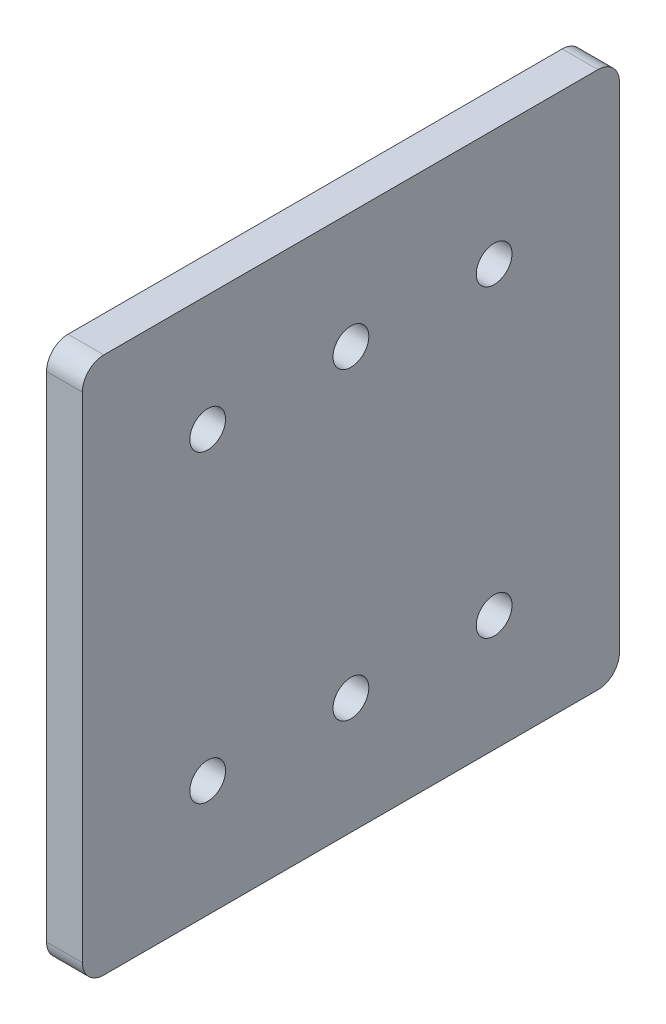
ISO-10303-21;
HEADER;
FILE_DESCRIPTION(('STEP AP214'),'2;1');
FILE_NAME('part.step','',(''),(''),'','','');
FILE_SCHEMA(('AUTOMOTIVE_DESIGN { 1 0 10303 214 1 1 1 1 }'));
ENDSEC;
DATA;
#1=APPLICATION_CONTEXT('core data for automotive mechanical design processes');
#2=APPLICATION_PROTOCOL_DEFINITION('international standard','automotive_design',2000,#1);
#3=PRODUCT_CONTEXT('',#1,'mechanical');
#4=PRODUCT('Part','Part','',(#3));
#5=PRODUCT_RELATED_PRODUCT_CATEGORY('part','',(#4));
#6=PRODUCT_DEFINITION_FORMATION('','',#4);
#7=PRODUCT_DEFINITION_CONTEXT('part definition',#1,'design');
#8=PRODUCT_DEFINITION('design','',#6,#7);
#9=PRODUCT_DEFINITION_SHAPE('','',#8);
#10=(LENGTH_UNIT() NAMED_UNIT(*) SI_UNIT(.MILLI.,.METRE.));
#11=(NAMED_UNIT(*) PLANE_ANGLE_UNIT() SI_UNIT($,.RADIAN.));
#12=(NAMED_UNIT(*) SI_UNIT($,.STERADIAN.) SOLID_ANGLE_UNIT());
#13=UNCERTAINTY_MEASURE_WITH_UNIT(LENGTH_MEASURE(1.E-05),#10,'distance_accuracy_value','');
#14=(GEOMETRIC_REPRESENTATION_CONTEXT(3) GLOBAL_UNCERTAINTY_ASSIGNED_CONTEXT((#13)) GLOBAL_UNIT_ASSIGNED_CONTEXT((#10,
#11,#12)) REPRESENTATION_CONTEXT('',''));
#15=CARTESIAN_POINT('',(0.,0.,0.));
#16=DIRECTION('',(0.,0.,1.));
#17=DIRECTION('',(1.,0.,0.));
#18=AXIS2_PLACEMENT_3D('',#15,#16,#17);
#19=CARTESIAN_POINT('',(418.,0.,0.));
#20=DIRECTION('',(-1.,0.,0.));
#21=DIRECTION('',(0.,0.,1.));
#22=AXIS2_PLACEMENT_3D('',#19,#20,#21);
#23=PLANE('',#22);
#24=DIRECTION('',(0.,-1.,0.));
#25=VECTOR('',#24,1.);
#26=CARTESIAN_POINT('',(418.,-21.2500000000011,1842.5));
#27=LINE('',#26,#25);
#28=CARTESIAN_POINT('',(418.,34.4999999999988,1842.5));
#29=VERTEX_POINT('',#28);
#30=CARTESIAN_POINT('',(418.,-34.500000000001,1842.5));
#31=VERTEX_POINT('',#30);
#32=EDGE_CURVE('E176',#29,#31,#27,.T.);
#33=ORIENTED_EDGE('',*,*,#32,.F.);
#34=CARTESIAN_POINT('',(418.,34.4999999999988,1845.5));
#35=DIRECTION('',(-1.,0.,0.));
#36=DIRECTION('',(0.,0.,1.));
#37=AXIS2_PLACEMENT_3D('',#34,#35,#36);
#38=CIRCLE('',#37,3.);
#39=CARTESIAN_POINT('',(418.,37.4999999999988,1845.5));
#40=VERTEX_POINT('',#39);
#41=EDGE_CURVE('E153',#29,#40,#38,.F.);
#42=ORIENTED_EDGE('',*,*,#41,.T.);
#43=DIRECTION('',(0.,0.,1.));
#44=VECTOR('',#43,1.);
#45=CARTESIAN_POINT('',(418.,37.4999999999988,1860.));
#46=LINE('',#45,#44);
#47=CARTESIAN_POINT('',(418.,37.4999999999988,1914.5));
#48=VERTEX_POINT('',#47);
#49=EDGE_CURVE('E124',#40,#48,#46,.T.);
#50=ORIENTED_EDGE('',*,*,#49,.T.);
#51=CARTESIAN_POINT('',(418.,34.4999999999988,1914.5));
#52=DIRECTION('',(-1.,0.,0.));
#53=DIRECTION('',(0.,0.,1.));
#54=AXIS2_PLACEMENT_3D('',#51,#52,#53);
#55=CIRCLE('',#54,3.);
#56=CARTESIAN_POINT('',(418.,34.4999999999988,1917.5));
#57=VERTEX_POINT('',#56);
#58=EDGE_CURVE('E148',#48,#57,#55,.F.);
#59=ORIENTED_EDGE('',*,*,#58,.T.);
#60=DIRECTION('',(0.,-1.,0.));
#61=VECTOR('',#60,1.);
#62=CARTESIAN_POINT('',(418.,-21.2500000000011,1917.5));
#63=LINE('',#62,#61);
#64=CARTESIAN_POINT('',(418.,-34.500000000001,1917.5));
#65=VERTEX_POINT('',#64);
#66=EDGE_CURVE('E131',#57,#65,#63,.T.);
#67=ORIENTED_EDGE('',*,*,#66,.T.);
#68=CARTESIAN_POINT('',(418.,-34.500000000001,1914.5));
#69=DIRECTION('',(-1.,0.,0.));
#70=DIRECTION('',(0.,0.,1.));
#71=AXIS2_PLACEMENT_3D('',#68,#69,#70);
#72=CIRCLE('',#71,3.);
#73=CARTESIAN_POINT('',(418.,-37.500000000001,1914.5));
#74=VERTEX_POINT('',#73);
#75=EDGE_CURVE('E53',#65,#74,#72,.F.);
#76=ORIENTED_EDGE('',*,*,#75,.T.);
#77=DIRECTION('',(0.,0.,1.));
#78=VECTOR('',#77,1.);
#79=CARTESIAN_POINT('',(418.,-37.500000000001,1860.));
#80=LINE('',#79,#78);
#81=CARTESIAN_POINT('',(418.,-37.500000000001,1845.5));
#82=VERTEX_POINT('',#81);
#83=EDGE_CURVE('E134',#82,#74,#80,.T.);
#84=ORIENTED_EDGE('',*,*,#83,.F.);
#85=CARTESIAN_POINT('',(418.,-34.500000000001,1845.5));
#86=DIRECTION('',(-1.,0.,0.));
#87=DIRECTION('',(0.,0.,1.));
#88=AXIS2_PLACEMENT_3D('',#85,#86,#87);
#89=CIRCLE('',#88,3.);
#90=EDGE_CURVE('E151',#82,#31,#89,.F.);
#91=ORIENTED_EDGE('',*,*,#90,.T.);
#92=EDGE_LOOP('',(#33,#42,#50,#59,#67,#76,#84,#91));
#93=FACE_BOUND('',#92,.T.);
#94=CARTESIAN_POINT('',(418.,-21.2500000000011,1900.));
#95=DIRECTION('',(1.,0.,0.));
#96=DIRECTION('',(0.,0.,-1.));
#97=AXIS2_PLACEMENT_3D('',#94,#95,#96);
#98=CIRCLE('',#97,2.49999999999999);
#99=CARTESIAN_POINT('',(418.,-21.2500000000011,1897.5));
#100=VERTEX_POINT('',#99);
#101=EDGE_CURVE('E169',#100,#100,#98,.T.);
#102=ORIENTED_EDGE('',*,*,#101,.F.);
#103=EDGE_LOOP('',(#102));
#104=FACE_BOUND('',#103,.T.);
#105=CARTESIAN_POINT('',(418.,-21.2500000000011,1860.));
#106=DIRECTION('',(1.,0.,0.));
#107=DIRECTION('',(0.,0.,-1.));
#108=AXIS2_PLACEMENT_3D('',#105,#106,#107);
#109=CIRCLE('',#108,2.49999999999999);
#110=CARTESIAN_POINT('',(418.,-21.2500000000011,1857.5));
#111=VERTEX_POINT('',#110);
#112=EDGE_CURVE('E181',#111,#111,#109,.T.);
#113=ORIENTED_EDGE('',*,*,#112,.F.);
#114=EDGE_LOOP('',(#113));
#115=FACE_BOUND('',#114,.T.);
#116=CARTESIAN_POINT('',(418.,21.2499999999989,1860.));
#117=DIRECTION('',(1.,0.,0.));
#118=DIRECTION('',(0.,0.,-1.));
#119=AXIS2_PLACEMENT_3D('',#116,#117,#118);
#120=CIRCLE('',#119,2.49999999999999);
#121=CARTESIAN_POINT('',(418.,21.2499999999989,1857.5));
#122=VERTEX_POINT('',#121);
#123=EDGE_CURVE('E186',#122,#122,#120,.T.);
#124=ORIENTED_EDGE('',*,*,#123,.F.);
#125=EDGE_LOOP('',(#124));
#126=FACE_BOUND('',#125,.T.);
#127=CARTESIAN_POINT('',(418.,21.2499999999989,1900.));
#128=DIRECTION('',(1.,0.,0.));
#129=DIRECTION('',(0.,0.,-1.));
#130=AXIS2_PLACEMENT_3D('',#127,#128,#129);
#131=CIRCLE('',#130,2.49999999999999);
#132=CARTESIAN_POINT('',(418.,21.2499999999989,1897.5));
#133=VERTEX_POINT('',#132);
#134=EDGE_CURVE('E192',#133,#133,#131,.T.);
#135=ORIENTED_EDGE('',*,*,#134,.F.);
#136=EDGE_LOOP('',(#135));
#137=FACE_BOUND('',#136,.T.);
#138=CARTESIAN_POINT('',(418.,-21.2500000000011,1880.));
#139=DIRECTION('',(1.,0.,0.));
#140=DIRECTION('',(0.,0.,-1.));
#141=AXIS2_PLACEMENT_3D('',#138,#139,#140);
#142=CIRCLE('',#141,2.49999999999999);
#143=CARTESIAN_POINT('',(418.,-21.2500000000011,1877.5));
#144=VERTEX_POINT('',#143);
#145=EDGE_CURVE('E198',#144,#144,#142,.T.);
#146=ORIENTED_EDGE('',*,*,#145,.F.);
#147=EDGE_LOOP('',(#146));
#148=FACE_BOUND('',#147,.T.);
#149=CARTESIAN_POINT('',(418.,21.2499999999989,1880.));
#150=DIRECTION('',(1.,0.,0.));
#151=DIRECTION('',(0.,0.,-1.));
#152=AXIS2_PLACEMENT_3D('',#149,#150,#151);
#153=CIRCLE('',#152,2.49999999999999);
#154=CARTESIAN_POINT('',(418.,21.2499999999989,1877.5));
#155=VERTEX_POINT('',#154);
#156=EDGE_CURVE('E204',#155,#155,#153,.T.);
#157=ORIENTED_EDGE('',*,*,#156,.F.);
#158=EDGE_LOOP('',(#157));
#159=FACE_BOUND('',#158,.T.);
#160=ADVANCED_FACE('F38',(#93,#104,#115,#126,#137,#148,#159),#23,.F.);
#161=CARTESIAN_POINT('',(413.,0.,0.));
#162=DIRECTION('',(-1.,0.,0.));
#163=DIRECTION('',(0.,0.,1.));
#164=AXIS2_PLACEMENT_3D('',#161,#162,#163);
#165=PLANE('',#164);
#166=CARTESIAN_POINT('',(413.,-21.2500000000011,1880.));
#167=DIRECTION('',(1.,0.,0.));
#168=DIRECTION('',(0.,0.,-1.));
#169=AXIS2_PLACEMENT_3D('',#166,#167,#168);
#170=CIRCLE('',#169,2.49999999999999);
#171=CARTESIAN_POINT('',(413.,-21.2500000000011,1877.5));
#172=VERTEX_POINT('',#171);
#173=EDGE_CURVE('E201',#172,#172,#170,.T.);
#174=ORIENTED_EDGE('',*,*,#173,.T.);
#175=EDGE_LOOP('',(#174));
#176=FACE_BOUND('',#175,.T.);
#177=CARTESIAN_POINT('',(413.,21.2499999999989,1860.));
#178=DIRECTION('',(1.,0.,0.));
#179=DIRECTION('',(0.,0.,-1.));
#180=AXIS2_PLACEMENT_3D('',#177,#178,#179);
#181=CIRCLE('',#180,2.49999999999999);
#182=CARTESIAN_POINT('',(413.,21.2499999999989,1857.5));
#183=VERTEX_POINT('',#182);
#184=EDGE_CURVE('E189',#183,#183,#181,.T.);
#185=ORIENTED_EDGE('',*,*,#184,.T.);
#186=EDGE_LOOP('',(#185));
#187=FACE_BOUND('',#186,.T.);
#188=CARTESIAN_POINT('',(413.,-21.2500000000011,1900.));
#189=DIRECTION('',(1.,0.,0.));
#190=DIRECTION('',(0.,0.,-1.));
#191=AXIS2_PLACEMENT_3D('',#188,#189,#190);
#192=CIRCLE('',#191,2.49999999999999);
#193=CARTESIAN_POINT('',(413.,-21.2500000000011,1897.5));
#194=VERTEX_POINT('',#193);
#195=EDGE_CURVE('E172',#194,#194,#192,.T.);
#196=ORIENTED_EDGE('',*,*,#195,.T.);
#197=EDGE_LOOP('',(#196));
#198=FACE_BOUND('',#197,.T.);
#199=DIRECTION('',(0.,0.,1.));
#200=VECTOR('',#199,1.);
#201=CARTESIAN_POINT('',(413.,37.4999999999988,1860.));
#202=LINE('',#201,#200);
#203=CARTESIAN_POINT('',(413.,37.4999999999988,1845.5));
#204=VERTEX_POINT('',#203);
#205=CARTESIAN_POINT('',(413.,37.4999999999988,1914.5));
#206=VERTEX_POINT('',#205);
#207=EDGE_CURVE('E121',#204,#206,#202,.T.);
#208=ORIENTED_EDGE('',*,*,#207,.F.);
#209=CARTESIAN_POINT('',(413.,34.4999999999988,1845.5));
#210=DIRECTION('',(-1.,0.,0.));
#211=DIRECTION('',(0.,0.,1.));
#212=AXIS2_PLACEMENT_3D('',#209,#210,#211);
#213=CIRCLE('',#212,3.);
#214=CARTESIAN_POINT('',(413.,34.4999999999988,1842.5));
#215=VERTEX_POINT('',#214);
#216=EDGE_CURVE('E104',#204,#215,#213,.T.);
#217=ORIENTED_EDGE('',*,*,#216,.T.);
#218=DIRECTION('',(0.,-1.,0.));
#219=VECTOR('',#218,1.);
#220=CARTESIAN_POINT('',(413.,-21.2500000000011,1842.5));
#221=LINE('',#220,#219);
#222=CARTESIAN_POINT('',(413.,-34.500000000001,1842.5));
#223=VERTEX_POINT('',#222);
#224=EDGE_CURVE('E132',#215,#223,#221,.T.);
#225=ORIENTED_EDGE('',*,*,#224,.T.);
#226=CARTESIAN_POINT('',(413.,-34.500000000001,1845.5));
#227=DIRECTION('',(-1.,0.,0.));
#228=DIRECTION('',(0.,0.,1.));
#229=AXIS2_PLACEMENT_3D('',#226,#227,#228);
#230=CIRCLE('',#229,3.);
#231=CARTESIAN_POINT('',(413.,-37.500000000001,1845.5));
#232=VERTEX_POINT('',#231);
#233=EDGE_CURVE('E115',#223,#232,#230,.T.);
#234=ORIENTED_EDGE('',*,*,#233,.T.);
#235=DIRECTION('',(0.,0.,1.));
#236=VECTOR('',#235,1.);
#237=CARTESIAN_POINT('',(413.,-37.500000000001,1860.));
#238=LINE('',#237,#236);
#239=CARTESIAN_POINT('',(413.,-37.500000000001,1914.5));
#240=VERTEX_POINT('',#239);
#241=EDGE_CURVE('E136',#232,#240,#238,.T.);
#242=ORIENTED_EDGE('',*,*,#241,.T.);
#243=CARTESIAN_POINT('',(413.,-34.500000000001,1914.5));
#244=DIRECTION('',(-1.,0.,0.));
#245=DIRECTION('',(0.,0.,1.));
#246=AXIS2_PLACEMENT_3D('',#243,#244,#245);
#247=CIRCLE('',#246,3.);
#248=CARTESIAN_POINT('',(413.,-34.500000000001,1917.5));
#249=VERTEX_POINT('',#248);
#250=EDGE_CURVE('E142',#240,#249,#247,.T.);
#251=ORIENTED_EDGE('',*,*,#250,.T.);
#252=DIRECTION('',(0.,-1.,0.));
#253=VECTOR('',#252,1.);
#254=CARTESIAN_POINT('',(413.,-21.2500000000011,1917.5));
#255=LINE('',#254,#253);
#256=CARTESIAN_POINT('',(413.,34.4999999999988,1917.5));
#257=VERTEX_POINT('',#256);
#258=EDGE_CURVE('E164',#257,#249,#255,.T.);
#259=ORIENTED_EDGE('',*,*,#258,.F.);
#260=CARTESIAN_POINT('',(413.,34.4999999999988,1914.5));
#261=DIRECTION('',(-1.,0.,0.));
#262=DIRECTION('',(0.,0.,1.));
#263=AXIS2_PLACEMENT_3D('',#260,#261,#262);
#264=CIRCLE('',#263,3.);
#265=EDGE_CURVE('E125',#257,#206,#264,.T.);
#266=ORIENTED_EDGE('',*,*,#265,.T.);
#267=EDGE_LOOP('',(#208,#217,#225,#234,#242,#251,#259,#266));
#268=FACE_BOUND('',#267,.T.);
#269=CARTESIAN_POINT('',(413.,-21.2500000000011,1860.));
#270=DIRECTION('',(1.,0.,0.));
#271=DIRECTION('',(0.,0.,-1.));
#272=AXIS2_PLACEMENT_3D('',#269,#270,#271);
#273=CIRCLE('',#272,2.49999999999999);
#274=CARTESIAN_POINT('',(413.,-21.2500000000011,1857.5));
#275=VERTEX_POINT('',#274);
#276=EDGE_CURVE('E183',#275,#275,#273,.T.);
#277=ORIENTED_EDGE('',*,*,#276,.T.);
#278=EDGE_LOOP('',(#277));
#279=FACE_BOUND('',#278,.T.);
#280=CARTESIAN_POINT('',(413.,21.2499999999989,1900.));
#281=DIRECTION('',(1.,0.,0.));
#282=DIRECTION('',(0.,0.,-1.));
#283=AXIS2_PLACEMENT_3D('',#280,#281,#282);
#284=CIRCLE('',#283,2.49999999999999);
#285=CARTESIAN_POINT('',(413.,21.2499999999989,1897.5));
#286=VERTEX_POINT('',#285);
#287=EDGE_CURVE('E195',#286,#286,#284,.T.);
#288=ORIENTED_EDGE('',*,*,#287,.T.);
#289=EDGE_LOOP('',(#288));
#290=FACE_BOUND('',#289,.T.);
#291=CARTESIAN_POINT('',(413.,21.2499999999989,1880.));
#292=DIRECTION('',(1.,0.,0.));
#293=DIRECTION('',(0.,0.,-1.));
#294=AXIS2_PLACEMENT_3D('',#291,#292,#293);
#295=CIRCLE('',#294,2.49999999999999);
#296=CARTESIAN_POINT('',(413.,21.2499999999989,1877.5));
#297=VERTEX_POINT('',#296);
#298=EDGE_CURVE('E207',#297,#297,#295,.T.);
#299=ORIENTED_EDGE('',*,*,#298,.T.);
#300=EDGE_LOOP('',(#299));
#301=FACE_BOUND('',#300,.T.);
#302=ADVANCED_FACE('F128',(#176,#187,#198,#268,#279,#290,#301),#165,.T.);
#303=CARTESIAN_POINT('',(418.,-21.2500000000011,1917.5));
#304=DIRECTION('',(0.,0.,-1.));
#305=DIRECTION('',(-1.,0.,0.));
#306=AXIS2_PLACEMENT_3D('',#303,#304,#305);
#307=PLANE('',#306);
#308=ORIENTED_EDGE('',*,*,#258,.T.);
#309=DIRECTION('',(-1.,0.,0.));
#310=VECTOR('',#309,1.);
#311=CARTESIAN_POINT('',(418.,-34.500000000001,1917.5));
#312=LINE('',#311,#310);
#313=EDGE_CURVE('E12',#249,#65,#312,.F.);
#314=ORIENTED_EDGE('',*,*,#313,.T.);
#315=ORIENTED_EDGE('',*,*,#66,.F.);
#316=DIRECTION('',(-1.,0.,0.));
#317=VECTOR('',#316,1.);
#318=CARTESIAN_POINT('',(418.,34.4999999999988,1917.5));
#319=LINE('',#318,#317);
#320=EDGE_CURVE('E46',#57,#257,#319,.T.);
#321=ORIENTED_EDGE('',*,*,#320,.T.);
#322=EDGE_LOOP('',(#308,#314,#315,#321));
#323=FACE_BOUND('',#322,.T.);
#324=ADVANCED_FACE('F163',(#323),#307,.F.);
#325=CARTESIAN_POINT('',(418.,-37.500000000001,1860.));
#326=DIRECTION('',(0.,-1.,0.));
#327=DIRECTION('',(1.,0.,0.));
#328=AXIS2_PLACEMENT_3D('',#325,#326,#327);
#329=PLANE('',#328);
#330=ORIENTED_EDGE('',*,*,#241,.F.);
#331=DIRECTION('',(-1.,0.,0.));
#332=VECTOR('',#331,1.);
#333=CARTESIAN_POINT('',(418.,-37.500000000001,1845.5));
#334=LINE('',#333,#332);
#335=EDGE_CURVE('E60',#232,#82,#334,.F.);
#336=ORIENTED_EDGE('',*,*,#335,.T.);
#337=ORIENTED_EDGE('',*,*,#83,.T.);
#338=DIRECTION('',(-1.,0.,0.));
#339=VECTOR('',#338,1.);
#340=CARTESIAN_POINT('',(413.,-37.500000000001,1914.5));
#341=LINE('',#340,#339);
#342=EDGE_CURVE('E155',#74,#240,#341,.T.);
#343=ORIENTED_EDGE('',*,*,#342,.T.);
#344=EDGE_LOOP('',(#330,#336,#337,#343));
#345=FACE_BOUND('',#344,.T.);
#346=ADVANCED_FACE('F235',(#345),#329,.T.);
#347=CARTESIAN_POINT('',(418.,-21.2500000000011,1842.5));
#348=DIRECTION('',(0.,0.,-1.));
#349=DIRECTION('',(-1.,0.,0.));
#350=AXIS2_PLACEMENT_3D('',#347,#348,#349);
#351=PLANE('',#350);
#352=ORIENTED_EDGE('',*,*,#224,.F.);
#353=DIRECTION('',(-1.,0.,0.));
#354=VECTOR('',#353,1.);
#355=CARTESIAN_POINT('',(418.,34.4999999999988,1842.5));
#356=LINE('',#355,#354);
#357=EDGE_CURVE('E109',#215,#29,#356,.F.);
#358=ORIENTED_EDGE('',*,*,#357,.T.);
#359=ORIENTED_EDGE('',*,*,#32,.T.);
#360=DIRECTION('',(-1.,0.,0.));
#361=VECTOR('',#360,1.);
#362=CARTESIAN_POINT('',(418.,-34.500000000001,1842.5));
#363=LINE('',#362,#361);
#364=EDGE_CURVE('E114',#31,#223,#363,.T.);
#365=ORIENTED_EDGE('',*,*,#364,.T.);
#366=EDGE_LOOP('',(#352,#358,#359,#365));
#367=FACE_BOUND('',#366,.T.);
#368=ADVANCED_FACE('F232',(#367),#351,.T.);
#369=CARTESIAN_POINT('',(418.,37.4999999999988,1860.));
#370=DIRECTION('',(0.,-1.,0.));
#371=DIRECTION('',(1.,0.,0.));
#372=AXIS2_PLACEMENT_3D('',#369,#370,#371);
#373=PLANE('',#372);
#374=ORIENTED_EDGE('',*,*,#49,.F.);
#375=DIRECTION('',(-1.,0.,0.));
#376=VECTOR('',#375,1.);
#377=CARTESIAN_POINT('',(413.,37.4999999999988,1845.5));
#378=LINE('',#377,#376);
#379=EDGE_CURVE('E108',#40,#204,#378,.T.);
#380=ORIENTED_EDGE('',*,*,#379,.T.);
#381=ORIENTED_EDGE('',*,*,#207,.T.);
#382=DIRECTION('',(-1.,0.,0.));
#383=VECTOR('',#382,1.);
#384=CARTESIAN_POINT('',(418.,37.4999999999988,1914.5));
#385=LINE('',#384,#383);
#386=EDGE_CURVE('E126',#206,#48,#385,.F.);
#387=ORIENTED_EDGE('',*,*,#386,.T.);
#388=EDGE_LOOP('',(#374,#380,#381,#387));
#389=FACE_BOUND('',#388,.T.);
#390=ADVANCED_FACE('F120',(#389),#373,.F.);
#391=CARTESIAN_POINT('',(418.,-21.2500000000011,1900.));
#392=DIRECTION('',(-1.,0.,0.));
#393=DIRECTION('',(0.,-1.,0.));
#394=AXIS2_PLACEMENT_3D('',#391,#392,#393);
#395=CYLINDRICAL_SURFACE('',#394,2.49999999999999);
#396=ORIENTED_EDGE('',*,*,#101,.T.);
#397=EDGE_LOOP('',(#396));
#398=FACE_BOUND('',#397,.T.);
#399=ORIENTED_EDGE('',*,*,#195,.F.);
#400=EDGE_LOOP('',(#399));
#401=FACE_BOUND('',#400,.T.);
#402=ADVANCED_FACE('F227',(#398,#401),#395,.F.);
#403=CARTESIAN_POINT('',(418.,-21.2500000000011,1860.));
#404=DIRECTION('',(-1.,0.,0.));
#405=DIRECTION('',(0.,-1.,0.));
#406=AXIS2_PLACEMENT_3D('',#403,#404,#405);
#407=CYLINDRICAL_SURFACE('',#406,2.49999999999999);
#408=ORIENTED_EDGE('',*,*,#112,.T.);
#409=EDGE_LOOP('',(#408));
#410=FACE_BOUND('',#409,.T.);
#411=ORIENTED_EDGE('',*,*,#276,.F.);
#412=EDGE_LOOP('',(#411));
#413=FACE_BOUND('',#412,.T.);
#414=ADVANCED_FACE('F348',(#410,#413),#407,.F.);
#415=CARTESIAN_POINT('',(418.,21.2499999999989,1860.));
#416=DIRECTION('',(-1.,0.,0.));
#417=DIRECTION('',(0.,-1.,0.));
#418=AXIS2_PLACEMENT_3D('',#415,#416,#417);
#419=CYLINDRICAL_SURFACE('',#418,2.49999999999999);
#420=ORIENTED_EDGE('',*,*,#123,.T.);
#421=EDGE_LOOP('',(#420));
#422=FACE_BOUND('',#421,.T.);
#423=ORIENTED_EDGE('',*,*,#184,.F.);
#424=EDGE_LOOP('',(#423));
#425=FACE_BOUND('',#424,.T.);
#426=ADVANCED_FACE('F355',(#422,#425),#419,.F.);
#427=CARTESIAN_POINT('',(418.,21.2499999999989,1900.));
#428=DIRECTION('',(-1.,0.,0.));
#429=DIRECTION('',(0.,-1.,0.));
#430=AXIS2_PLACEMENT_3D('',#427,#428,#429);
#431=CYLINDRICAL_SURFACE('',#430,2.49999999999999);
#432=ORIENTED_EDGE('',*,*,#134,.T.);
#433=EDGE_LOOP('',(#432));
#434=FACE_BOUND('',#433,.T.);
#435=ORIENTED_EDGE('',*,*,#287,.F.);
#436=EDGE_LOOP('',(#435));
#437=FACE_BOUND('',#436,.T.);
#438=ADVANCED_FACE('F362',(#434,#437),#431,.F.);
#439=CARTESIAN_POINT('',(418.,-21.2500000000011,1880.));
#440=DIRECTION('',(-1.,0.,0.));
#441=DIRECTION('',(0.,-1.,0.));
#442=AXIS2_PLACEMENT_3D('',#439,#440,#441);
#443=CYLINDRICAL_SURFACE('',#442,2.49999999999999);
#444=ORIENTED_EDGE('',*,*,#145,.T.);
#445=EDGE_LOOP('',(#444));
#446=FACE_BOUND('',#445,.T.);
#447=ORIENTED_EDGE('',*,*,#173,.F.);
#448=EDGE_LOOP('',(#447));
#449=FACE_BOUND('',#448,.T.);
#450=ADVANCED_FACE('F370',(#446,#449),#443,.F.);
#451=CARTESIAN_POINT('',(418.,21.2499999999989,1880.));
#452=DIRECTION('',(-1.,0.,0.));
#453=DIRECTION('',(0.,-1.,0.));
#454=AXIS2_PLACEMENT_3D('',#451,#452,#453);
#455=CYLINDRICAL_SURFACE('',#454,2.49999999999999);
#456=ORIENTED_EDGE('',*,*,#156,.T.);
#457=EDGE_LOOP('',(#456));
#458=FACE_BOUND('',#457,.T.);
#459=ORIENTED_EDGE('',*,*,#298,.F.);
#460=EDGE_LOOP('',(#459));
#461=FACE_BOUND('',#460,.T.);
#462=ADVANCED_FACE('F213',(#458,#461),#455,.F.);
#463=CARTESIAN_POINT('',(418.,34.4999999999988,1845.5));
#464=DIRECTION('',(1.,0.,0.));
#465=DIRECTION('',(0.,1.,0.));
#466=AXIS2_PLACEMENT_3D('',#463,#464,#465);
#467=CYLINDRICAL_SURFACE('',#466,3.);
#468=ORIENTED_EDGE('',*,*,#41,.F.);
#469=ORIENTED_EDGE('',*,*,#357,.F.);
#470=ORIENTED_EDGE('',*,*,#216,.F.);
#471=ORIENTED_EDGE('',*,*,#379,.F.);
#472=EDGE_LOOP('',(#468,#469,#470,#471));
#473=FACE_BOUND('',#472,.T.);
#474=ADVANCED_FACE('F107',(#473),#467,.T.);
#475=CARTESIAN_POINT('',(418.,-34.500000000001,1845.5));
#476=DIRECTION('',(-1.,0.,0.));
#477=DIRECTION('',(0.,-1.,0.));
#478=AXIS2_PLACEMENT_3D('',#475,#476,#477);
#479=CYLINDRICAL_SURFACE('',#478,3.);
#480=ORIENTED_EDGE('',*,*,#90,.F.);
#481=ORIENTED_EDGE('',*,*,#335,.F.);
#482=ORIENTED_EDGE('',*,*,#233,.F.);
#483=ORIENTED_EDGE('',*,*,#364,.F.);
#484=EDGE_LOOP('',(#480,#481,#482,#483));
#485=FACE_BOUND('',#484,.T.);
#486=ADVANCED_FACE('F243',(#485),#479,.T.);
#487=CARTESIAN_POINT('',(418.,-34.500000000001,1914.5));
#488=DIRECTION('',(1.,0.,0.));
#489=DIRECTION('',(0.,1.,0.));
#490=AXIS2_PLACEMENT_3D('',#487,#488,#489);
#491=CYLINDRICAL_SURFACE('',#490,3.);
#492=ORIENTED_EDGE('',*,*,#75,.F.);
#493=ORIENTED_EDGE('',*,*,#313,.F.);
#494=ORIENTED_EDGE('',*,*,#250,.F.);
#495=ORIENTED_EDGE('',*,*,#342,.F.);
#496=EDGE_LOOP('',(#492,#493,#494,#495));
#497=FACE_BOUND('',#496,.T.);
#498=ADVANCED_FACE('F245',(#497),#491,.T.);
#499=CARTESIAN_POINT('',(418.,34.4999999999988,1914.5));
#500=DIRECTION('',(-1.,0.,0.));
#501=DIRECTION('',(0.,-1.,0.));
#502=AXIS2_PLACEMENT_3D('',#499,#500,#501);
#503=CYLINDRICAL_SURFACE('',#502,3.);
#504=ORIENTED_EDGE('',*,*,#58,.F.);
#505=ORIENTED_EDGE('',*,*,#386,.F.);
#506=ORIENTED_EDGE('',*,*,#265,.F.);
#507=ORIENTED_EDGE('',*,*,#320,.F.);
#508=EDGE_LOOP('',(#504,#505,#506,#507));
#509=FACE_BOUND('',#508,.T.);
#510=ADVANCED_FACE('F40',(#509),#503,.T.);
#511=CLOSED_SHELL('',(#160,#302,#324,#346,#368,#390,#402,#414,#426,#438,#450,#462,#474,#486,
#498,#510));
#512=MANIFOLD_SOLID_BREP('B2',#511);
#513=ADVANCED_BREP_SHAPE_REPRESENTATION('',(#18,#512),#14);
#514=SHAPE_DEFINITION_REPRESENTATION(#9,#513);
ENDSEC;
END-ISO-10303-21;
